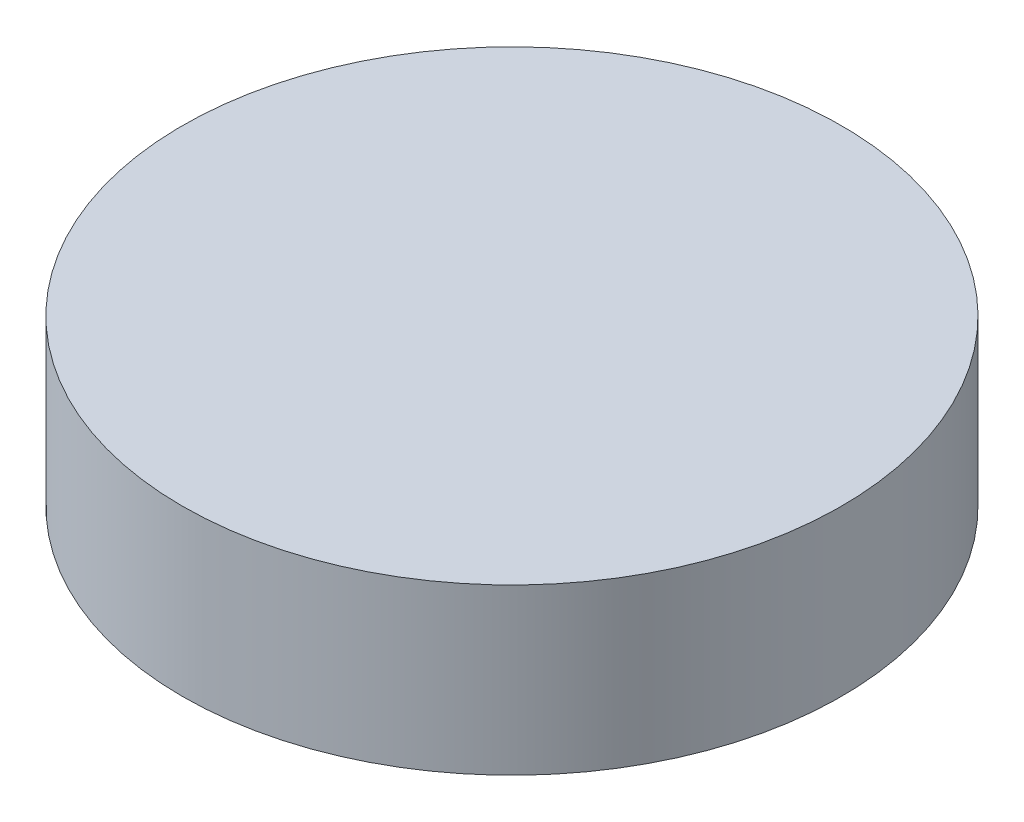
ISO-10303-21;
HEADER;
FILE_DESCRIPTION(('STEP AP214'),'2;1');
FILE_NAME('part.step','',(''),(''),'','','');
FILE_SCHEMA(('AUTOMOTIVE_DESIGN { 1 0 10303 214 1 1 1 1 }'));
ENDSEC;
DATA;
#1=APPLICATION_CONTEXT('core data for automotive mechanical design processes');
#2=APPLICATION_PROTOCOL_DEFINITION('international standard','automotive_design',2000,#1);
#3=PRODUCT_CONTEXT('',#1,'mechanical');
#4=PRODUCT('Part','Part','',(#3));
#5=PRODUCT_RELATED_PRODUCT_CATEGORY('part','',(#4));
#6=PRODUCT_DEFINITION_FORMATION('','',#4);
#7=PRODUCT_DEFINITION_CONTEXT('part definition',#1,'design');
#8=PRODUCT_DEFINITION('design','',#6,#7);
#9=PRODUCT_DEFINITION_SHAPE('','',#8);
#10=(LENGTH_UNIT() NAMED_UNIT(*) SI_UNIT(.MILLI.,.METRE.));
#11=(NAMED_UNIT(*) PLANE_ANGLE_UNIT() SI_UNIT($,.RADIAN.));
#12=(NAMED_UNIT(*) SI_UNIT($,.STERADIAN.) SOLID_ANGLE_UNIT());
#13=UNCERTAINTY_MEASURE_WITH_UNIT(LENGTH_MEASURE(1.E-05),#10,'distance_accuracy_value','');
#14=(GEOMETRIC_REPRESENTATION_CONTEXT(3) GLOBAL_UNCERTAINTY_ASSIGNED_CONTEXT((#13)) GLOBAL_UNIT_ASSIGNED_CONTEXT((#10,
#11,#12)) REPRESENTATION_CONTEXT('',''));
#15=CARTESIAN_POINT('',(0.,0.,0.));
#16=DIRECTION('',(0.,0.,1.));
#17=DIRECTION('',(1.,0.,0.));
#18=AXIS2_PLACEMENT_3D('',#15,#16,#17);
#19=CARTESIAN_POINT('',(0.,10.,0.));
#20=DIRECTION('',(0.,-1.,0.));
#21=DIRECTION('',(0.,0.,-1.));
#22=AXIS2_PLACEMENT_3D('',#19,#20,#21);
#23=CYLINDRICAL_SURFACE('',#22,20.);
#24=CARTESIAN_POINT('',(0.,10.,0.));
#25=DIRECTION('',(0.,1.,0.));
#26=DIRECTION('',(0.,0.,1.));
#27=AXIS2_PLACEMENT_3D('',#24,#25,#26);
#28=CIRCLE('',#27,20.);
#29=CARTESIAN_POINT('',(0.,10.,20.));
#30=VERTEX_POINT('',#29);
#31=EDGE_CURVE('E10',#30,#30,#28,.T.);
#32=ORIENTED_EDGE('',*,*,#31,.F.);
#33=EDGE_LOOP('',(#32));
#34=FACE_BOUND('',#33,.T.);
#35=CARTESIAN_POINT('',(0.,0.,0.));
#36=DIRECTION('',(0.,1.,0.));
#37=DIRECTION('',(0.,0.,1.));
#38=AXIS2_PLACEMENT_3D('',#35,#36,#37);
#39=CIRCLE('',#38,20.);
#40=CARTESIAN_POINT('',(0.,0.,20.));
#41=VERTEX_POINT('',#40);
#42=EDGE_CURVE('E39',#41,#41,#39,.T.);
#43=ORIENTED_EDGE('',*,*,#42,.T.);
#44=EDGE_LOOP('',(#43));
#45=FACE_BOUND('',#44,.T.);
#46=ADVANCED_FACE('F36',(#34,#45),#23,.T.);
#47=CARTESIAN_POINT('',(0.,10.,0.));
#48=DIRECTION('',(0.,1.,0.));
#49=DIRECTION('',(0.,0.,1.));
#50=AXIS2_PLACEMENT_3D('',#47,#48,#49);
#51=PLANE('',#50);
#52=ORIENTED_EDGE('',*,*,#31,.T.);
#53=EDGE_LOOP('',(#52));
#54=FACE_BOUND('',#53,.T.);
#55=ADVANCED_FACE('F66',(#54),#51,.T.);
#56=CARTESIAN_POINT('',(0.,0.,0.));
#57=DIRECTION('',(0.,1.,0.));
#58=DIRECTION('',(0.,0.,1.));
#59=AXIS2_PLACEMENT_3D('',#56,#57,#58);
#60=PLANE('',#59);
#61=CARTESIAN_POINT('',(0.,0.,0.));
#62=DIRECTION('',(0.,1.,0.));
#63=DIRECTION('',(0.,0.,1.));
#64=AXIS2_PLACEMENT_3D('',#61,#62,#63);
#65=CIRCLE('',#64,5.);
#66=CARTESIAN_POINT('',(0.,0.,5.));
#67=VERTEX_POINT('',#66);
#68=EDGE_CURVE('E48',#67,#67,#65,.T.);
#69=ORIENTED_EDGE('',*,*,#68,.T.);
#70=EDGE_LOOP('',(#69));
#71=FACE_BOUND('',#70,.T.);
#72=ORIENTED_EDGE('',*,*,#42,.F.);
#73=EDGE_LOOP('',(#72));
#74=FACE_BOUND('',#73,.T.);
#75=ADVANCED_FACE('F63',(#71,#74),#60,.F.);
#76=CARTESIAN_POINT('',(0.,5.,0.));
#77=DIRECTION('',(0.,-1.,0.));
#78=DIRECTION('',(0.,0.,-1.));
#79=AXIS2_PLACEMENT_3D('',#76,#77,#78);
#80=CYLINDRICAL_SURFACE('',#79,5.);
#81=CARTESIAN_POINT('',(0.,5.,0.));
#82=DIRECTION('',(0.,1.,0.));
#83=DIRECTION('',(0.,0.,1.));
#84=AXIS2_PLACEMENT_3D('',#81,#82,#83);
#85=CIRCLE('',#84,5.);
#86=CARTESIAN_POINT('',(0.,5.,5.));
#87=VERTEX_POINT('',#86);
#88=EDGE_CURVE('E46',#87,#87,#85,.T.);
#89=ORIENTED_EDGE('',*,*,#88,.T.);
#90=EDGE_LOOP('',(#89));
#91=FACE_BOUND('',#90,.T.);
#92=ORIENTED_EDGE('',*,*,#68,.F.);
#93=EDGE_LOOP('',(#92));
#94=FACE_BOUND('',#93,.T.);
#95=ADVANCED_FACE('F54',(#91,#94),#80,.F.);
#96=CARTESIAN_POINT('',(0.,5.,0.));
#97=DIRECTION('',(0.,1.,0.));
#98=DIRECTION('',(0.,0.,1.));
#99=AXIS2_PLACEMENT_3D('',#96,#97,#98);
#100=PLANE('',#99);
#101=ORIENTED_EDGE('',*,*,#88,.F.);
#102=EDGE_LOOP('',(#101));
#103=FACE_BOUND('',#102,.T.);
#104=ADVANCED_FACE('F57',(#103),#100,.F.);
#105=CLOSED_SHELL('',(#46,#55,#75,#95,#104));
#106=MANIFOLD_SOLID_BREP('B2',#105);
#107=ADVANCED_BREP_SHAPE_REPRESENTATION('',(#18,#106),#14);
#108=SHAPE_DEFINITION_REPRESENTATION(#9,#107);
ENDSEC;
END-ISO-10303-21;
